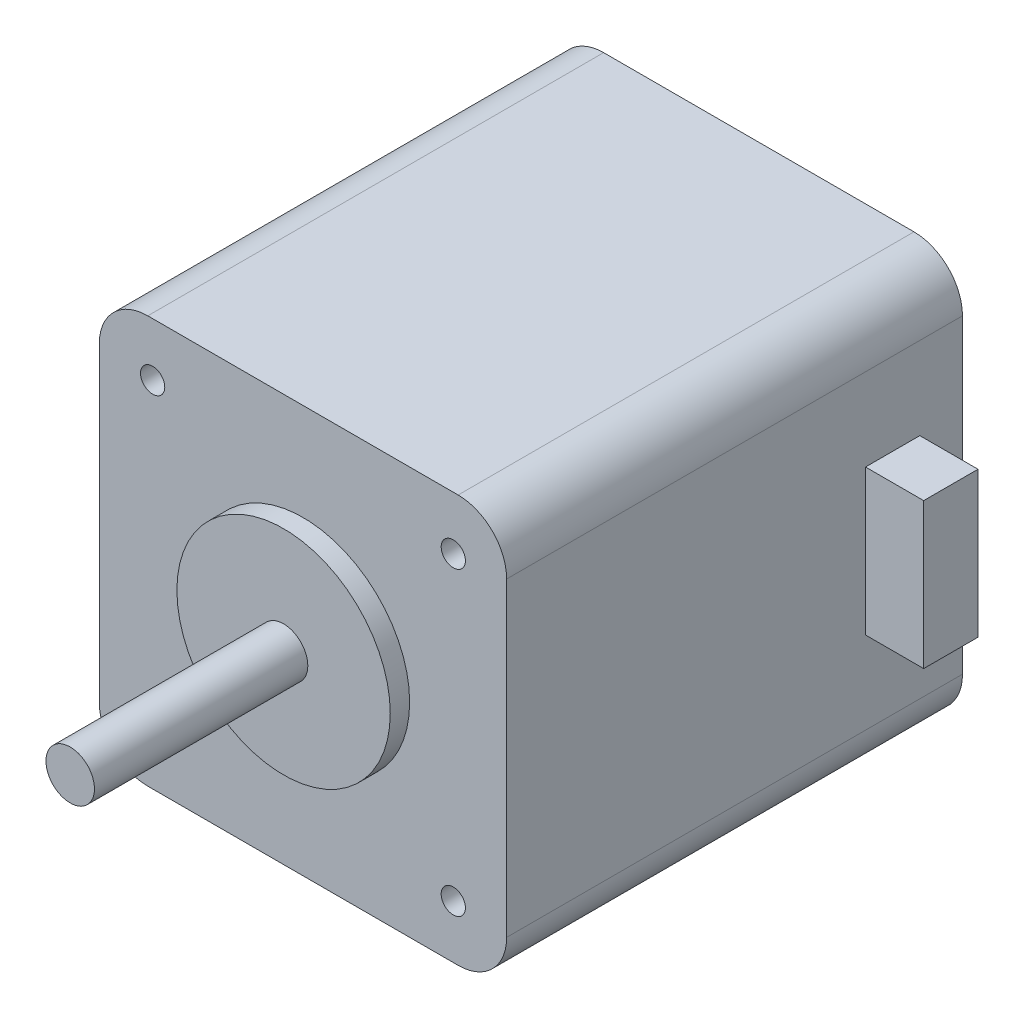
ISO-10303-21;
HEADER;
FILE_DESCRIPTION(('STEP AP214'),'2;1');
FILE_NAME('part.step','',(''),(''),'','','');
FILE_SCHEMA(('AUTOMOTIVE_DESIGN { 1 0 10303 214 1 1 1 1 }'));
ENDSEC;
DATA;
#1=APPLICATION_CONTEXT('core data for automotive mechanical design processes');
#2=APPLICATION_PROTOCOL_DEFINITION('international standard','automotive_design',2000,#1);
#3=PRODUCT_CONTEXT('',#1,'mechanical');
#4=PRODUCT('Part','Part','',(#3));
#5=PRODUCT_RELATED_PRODUCT_CATEGORY('part','',(#4));
#6=PRODUCT_DEFINITION_FORMATION('','',#4);
#7=PRODUCT_DEFINITION_CONTEXT('part definition',#1,'design');
#8=PRODUCT_DEFINITION('design','',#6,#7);
#9=PRODUCT_DEFINITION_SHAPE('','',#8);
#10=(LENGTH_UNIT() NAMED_UNIT(*) SI_UNIT(.MILLI.,.METRE.));
#11=(NAMED_UNIT(*) PLANE_ANGLE_UNIT() SI_UNIT($,.RADIAN.));
#12=(NAMED_UNIT(*) SI_UNIT($,.STERADIAN.) SOLID_ANGLE_UNIT());
#13=UNCERTAINTY_MEASURE_WITH_UNIT(LENGTH_MEASURE(1.E-05),#10,'distance_accuracy_value','');
#14=(GEOMETRIC_REPRESENTATION_CONTEXT(3) GLOBAL_UNCERTAINTY_ASSIGNED_CONTEXT((#13)) GLOBAL_UNIT_ASSIGNED_CONTEXT((#10,
#11,#12)) REPRESENTATION_CONTEXT('',''));
#15=CARTESIAN_POINT('',(0.,0.,0.));
#16=DIRECTION('',(0.,0.,1.));
#17=DIRECTION('',(1.,0.,0.));
#18=AXIS2_PLACEMENT_3D('',#15,#16,#17);
#19=CARTESIAN_POINT('',(21.,21.,47.));
#20=DIRECTION('',(1.,0.,0.));
#21=DIRECTION('',(0.,1.,0.));
#22=AXIS2_PLACEMENT_3D('',#19,#20,#21);
#23=PLANE('',#22);
#24=DIRECTION('',(0.,-1.,0.));
#25=VECTOR('',#24,1.);
#26=CARTESIAN_POINT('',(21.,21.,47.));
#27=LINE('',#26,#25);
#28=CARTESIAN_POINT('',(21.,16.,47.));
#29=VERTEX_POINT('',#28);
#30=CARTESIAN_POINT('',(21.,-16.,47.));
#31=VERTEX_POINT('',#30);
#32=EDGE_CURVE('E231',#29,#31,#27,.T.);
#33=ORIENTED_EDGE('',*,*,#32,.T.);
#34=DIRECTION('',(0.,0.,-1.));
#35=VECTOR('',#34,1.);
#36=CARTESIAN_POINT('',(21.,-16.,0.));
#37=LINE('',#36,#35);
#38=CARTESIAN_POINT('',(21.,-16.,0.));
#39=VERTEX_POINT('',#38);
#40=EDGE_CURVE('E11',#31,#39,#37,.T.);
#41=ORIENTED_EDGE('',*,*,#40,.T.);
#42=DIRECTION('',(0.,-1.,0.));
#43=VECTOR('',#42,1.);
#44=CARTESIAN_POINT('',(21.,21.,0.));
#45=LINE('',#44,#43);
#46=CARTESIAN_POINT('',(21.,16.,0.));
#47=VERTEX_POINT('',#46);
#48=EDGE_CURVE('E247',#47,#39,#45,.T.);
#49=ORIENTED_EDGE('',*,*,#48,.F.);
#50=DIRECTION('',(0.,0.,-1.));
#51=VECTOR('',#50,1.);
#52=CARTESIAN_POINT('',(21.,16.,47.));
#53=LINE('',#52,#51);
#54=EDGE_CURVE('E54',#47,#29,#53,.F.);
#55=ORIENTED_EDGE('',*,*,#54,.T.);
#56=EDGE_LOOP('',(#33,#41,#49,#55));
#57=FACE_BOUND('',#56,.T.);
#58=DIRECTION('',(0.,-1.,0.));
#59=VECTOR('',#58,1.);
#60=CARTESIAN_POINT('',(21.,7.5,10.));
#61=LINE('',#60,#59);
#62=CARTESIAN_POINT('',(21.,7.5,10.));
#63=VERTEX_POINT('',#62);
#64=CARTESIAN_POINT('',(21.,-7.5,10.));
#65=VERTEX_POINT('',#64);
#66=EDGE_CURVE('E620',#63,#65,#61,.T.);
#67=ORIENTED_EDGE('',*,*,#66,.F.);
#68=DIRECTION('',(0.,0.,1.));
#69=VECTOR('',#68,1.);
#70=CARTESIAN_POINT('',(21.,7.5,4.4));
#71=LINE('',#70,#69);
#72=CARTESIAN_POINT('',(21.,7.5,4.4));
#73=VERTEX_POINT('',#72);
#74=EDGE_CURVE('E174',#73,#63,#71,.T.);
#75=ORIENTED_EDGE('',*,*,#74,.F.);
#76=DIRECTION('',(0.,1.,0.));
#77=VECTOR('',#76,1.);
#78=CARTESIAN_POINT('',(21.,-7.5,4.4));
#79=LINE('',#78,#77);
#80=CARTESIAN_POINT('',(21.,-7.5,4.4));
#81=VERTEX_POINT('',#80);
#82=EDGE_CURVE('E170',#81,#73,#79,.T.);
#83=ORIENTED_EDGE('',*,*,#82,.F.);
#84=DIRECTION('',(0.,0.,-1.));
#85=VECTOR('',#84,1.);
#86=CARTESIAN_POINT('',(21.,-7.5,10.));
#87=LINE('',#86,#85);
#88=EDGE_CURVE('E616',#65,#81,#87,.T.);
#89=ORIENTED_EDGE('',*,*,#88,.F.);
#90=EDGE_LOOP('',(#67,#75,#83,#89));
#91=FACE_BOUND('',#90,.T.);
#92=ADVANCED_FACE('F45',(#57,#91),#23,.T.);
#93=CARTESIAN_POINT('',(0.,0.,47.));
#94=DIRECTION('',(0.,0.,-1.));
#95=DIRECTION('',(-1.,0.,0.));
#96=AXIS2_PLACEMENT_3D('',#93,#94,#95);
#97=PLANE('',#96);
#98=CARTESIAN_POINT('',(15.4999999999998,15.5000000000002,47.));
#99=DIRECTION('',(0.,0.,1.));
#100=DIRECTION('',(1.,0.,0.));
#101=AXIS2_PLACEMENT_3D('',#98,#99,#100);
#102=CIRCLE('',#101,1.25);
#103=CARTESIAN_POINT('',(16.7499999999998,15.5000000000002,47.));
#104=VERTEX_POINT('',#103);
#105=EDGE_CURVE('E177',#104,#104,#102,.T.);
#106=ORIENTED_EDGE('',*,*,#105,.F.);
#107=EDGE_LOOP('',(#106));
#108=FACE_BOUND('',#107,.T.);
#109=CARTESIAN_POINT('',(15.5,-15.5,47.));
#110=DIRECTION('',(0.,0.,1.));
#111=DIRECTION('',(1.,0.,0.));
#112=AXIS2_PLACEMENT_3D('',#109,#110,#111);
#113=CIRCLE('',#112,1.25);
#114=CARTESIAN_POINT('',(16.75,-15.5,47.));
#115=VERTEX_POINT('',#114);
#116=EDGE_CURVE('E190',#115,#115,#113,.T.);
#117=ORIENTED_EDGE('',*,*,#116,.F.);
#118=EDGE_LOOP('',(#117));
#119=FACE_BOUND('',#118,.T.);
#120=CARTESIAN_POINT('',(-15.4999999999999,-15.5000000000001,47.));
#121=DIRECTION('',(0.,0.,1.));
#122=DIRECTION('',(1.,0.,0.));
#123=AXIS2_PLACEMENT_3D('',#120,#121,#122);
#124=CIRCLE('',#123,1.25);
#125=CARTESIAN_POINT('',(-14.2499999999999,-15.5000000000001,47.));
#126=VERTEX_POINT('',#125);
#127=EDGE_CURVE('E198',#126,#126,#124,.T.);
#128=ORIENTED_EDGE('',*,*,#127,.F.);
#129=EDGE_LOOP('',(#128));
#130=FACE_BOUND('',#129,.T.);
#131=CARTESIAN_POINT('',(-15.5,15.5,47.));
#132=DIRECTION('',(0.,0.,1.));
#133=DIRECTION('',(1.,0.,0.));
#134=AXIS2_PLACEMENT_3D('',#131,#132,#133);
#135=CIRCLE('',#134,1.25);
#136=CARTESIAN_POINT('',(-14.25,15.5,47.));
#137=VERTEX_POINT('',#136);
#138=EDGE_CURVE('E206',#137,#137,#135,.T.);
#139=ORIENTED_EDGE('',*,*,#138,.F.);
#140=EDGE_LOOP('',(#139));
#141=FACE_BOUND('',#140,.T.);
#142=DIRECTION('',(0.,-1.,0.));
#143=VECTOR('',#142,1.);
#144=CARTESIAN_POINT('',(-21.,21.,47.));
#145=LINE('',#144,#143);
#146=CARTESIAN_POINT('',(-21.,16.,47.));
#147=VERTEX_POINT('',#146);
#148=CARTESIAN_POINT('',(-21.,-16.,47.));
#149=VERTEX_POINT('',#148);
#150=EDGE_CURVE('E239',#147,#149,#145,.T.);
#151=ORIENTED_EDGE('',*,*,#150,.T.);
#152=CARTESIAN_POINT('',(-16.,-16.,47.));
#153=DIRECTION('',(0.,0.,-1.));
#154=DIRECTION('',(-1.,0.,0.));
#155=AXIS2_PLACEMENT_3D('',#152,#153,#154);
#156=CIRCLE('',#155,5.);
#157=CARTESIAN_POINT('',(-16.,-21.,47.));
#158=VERTEX_POINT('',#157);
#159=EDGE_CURVE('E295',#149,#158,#156,.F.);
#160=ORIENTED_EDGE('',*,*,#159,.T.);
#161=DIRECTION('',(1.,0.,0.));
#162=VECTOR('',#161,1.);
#163=CARTESIAN_POINT('',(-21.,-21.,47.));
#164=LINE('',#163,#162);
#165=CARTESIAN_POINT('',(16.,-21.,47.));
#166=VERTEX_POINT('',#165);
#167=EDGE_CURVE('E227',#158,#166,#164,.T.);
#168=ORIENTED_EDGE('',*,*,#167,.T.);
#169=CARTESIAN_POINT('',(16.,-16.,47.));
#170=DIRECTION('',(0.,0.,-1.));
#171=DIRECTION('',(-1.,0.,0.));
#172=AXIS2_PLACEMENT_3D('',#169,#170,#171);
#173=CIRCLE('',#172,5.);
#174=EDGE_CURVE('E289',#166,#31,#173,.F.);
#175=ORIENTED_EDGE('',*,*,#174,.T.);
#176=ORIENTED_EDGE('',*,*,#32,.F.);
#177=CARTESIAN_POINT('',(16.,16.,47.));
#178=DIRECTION('',(0.,0.,-1.));
#179=DIRECTION('',(-1.,0.,0.));
#180=AXIS2_PLACEMENT_3D('',#177,#178,#179);
#181=CIRCLE('',#180,5.);
#182=CARTESIAN_POINT('',(16.,21.,47.));
#183=VERTEX_POINT('',#182);
#184=EDGE_CURVE('E69',#29,#183,#181,.F.);
#185=ORIENTED_EDGE('',*,*,#184,.T.);
#186=DIRECTION('',(1.,0.,0.));
#187=VECTOR('',#186,1.);
#188=CARTESIAN_POINT('',(-21.,21.,47.));
#189=LINE('',#188,#187);
#190=CARTESIAN_POINT('',(-16.,21.,47.));
#191=VERTEX_POINT('',#190);
#192=EDGE_CURVE('E236',#191,#183,#189,.T.);
#193=ORIENTED_EDGE('',*,*,#192,.F.);
#194=CARTESIAN_POINT('',(-16.,16.,47.));
#195=DIRECTION('',(0.,0.,-1.));
#196=DIRECTION('',(-1.,0.,0.));
#197=AXIS2_PLACEMENT_3D('',#194,#195,#196);
#198=CIRCLE('',#197,5.);
#199=EDGE_CURVE('E292',#191,#147,#198,.F.);
#200=ORIENTED_EDGE('',*,*,#199,.T.);
#201=EDGE_LOOP('',(#151,#160,#168,#175,#176,#185,#193,#200));
#202=FACE_BOUND('',#201,.T.);
#203=CARTESIAN_POINT('',(0.,0.,47.));
#204=DIRECTION('',(0.,0.,-1.));
#205=DIRECTION('',(-1.,0.,0.));
#206=AXIS2_PLACEMENT_3D('',#203,#204,#205);
#207=CIRCLE('',#206,11.);
#208=CARTESIAN_POINT('',(-11.,0.,47.));
#209=VERTEX_POINT('',#208);
#210=EDGE_CURVE('E243',#209,#209,#207,.F.);
#211=ORIENTED_EDGE('',*,*,#210,.F.);
#212=EDGE_LOOP('',(#211));
#213=FACE_BOUND('',#212,.T.);
#214=ADVANCED_FACE('F311',(#108,#119,#130,#141,#202,#213),#97,.F.);
#215=CARTESIAN_POINT('',(-21.,-21.,47.));
#216=DIRECTION('',(0.,1.,0.));
#217=DIRECTION('',(0.,0.,1.));
#218=AXIS2_PLACEMENT_3D('',#215,#216,#217);
#219=PLANE('',#218);
#220=ORIENTED_EDGE('',*,*,#167,.F.);
#221=DIRECTION('',(0.,0.,-1.));
#222=VECTOR('',#221,1.);
#223=CARTESIAN_POINT('',(-16.,-21.,47.));
#224=LINE('',#223,#222);
#225=CARTESIAN_POINT('',(-16.,-21.,0.));
#226=VERTEX_POINT('',#225);
#227=EDGE_CURVE('E264',#158,#226,#224,.T.);
#228=ORIENTED_EDGE('',*,*,#227,.T.);
#229=DIRECTION('',(1.,0.,0.));
#230=VECTOR('',#229,1.);
#231=CARTESIAN_POINT('',(-21.,-21.,0.));
#232=LINE('',#231,#230);
#233=CARTESIAN_POINT('',(16.,-21.,0.));
#234=VERTEX_POINT('',#233);
#235=EDGE_CURVE('E226',#226,#234,#232,.T.);
#236=ORIENTED_EDGE('',*,*,#235,.T.);
#237=DIRECTION('',(0.,0.,-1.));
#238=VECTOR('',#237,1.);
#239=CARTESIAN_POINT('',(16.,-21.,47.));
#240=LINE('',#239,#238);
#241=EDGE_CURVE('E261',#234,#166,#240,.F.);
#242=ORIENTED_EDGE('',*,*,#241,.T.);
#243=EDGE_LOOP('',(#220,#228,#236,#242));
#244=FACE_BOUND('',#243,.T.);
#245=ADVANCED_FACE('F337',(#244),#219,.F.);
#246=CARTESIAN_POINT('',(-21.,21.,47.));
#247=DIRECTION('',(0.,1.,0.));
#248=DIRECTION('',(0.,0.,1.));
#249=AXIS2_PLACEMENT_3D('',#246,#247,#248);
#250=PLANE('',#249);
#251=DIRECTION('',(1.,0.,0.));
#252=VECTOR('',#251,1.);
#253=CARTESIAN_POINT('',(-21.,21.,0.));
#254=LINE('',#253,#252);
#255=CARTESIAN_POINT('',(-16.,21.,0.));
#256=VERTEX_POINT('',#255);
#257=CARTESIAN_POINT('',(16.,21.,0.));
#258=VERTEX_POINT('',#257);
#259=EDGE_CURVE('E251',#256,#258,#254,.T.);
#260=ORIENTED_EDGE('',*,*,#259,.F.);
#261=DIRECTION('',(0.,0.,-1.));
#262=VECTOR('',#261,1.);
#263=CARTESIAN_POINT('',(-16.,21.,47.));
#264=LINE('',#263,#262);
#265=EDGE_CURVE('E302',#256,#191,#264,.F.);
#266=ORIENTED_EDGE('',*,*,#265,.T.);
#267=ORIENTED_EDGE('',*,*,#192,.T.);
#268=DIRECTION('',(0.,0.,-1.));
#269=VECTOR('',#268,1.);
#270=CARTESIAN_POINT('',(16.,21.,47.));
#271=LINE('',#270,#269);
#272=EDGE_CURVE('E298',#183,#258,#271,.T.);
#273=ORIENTED_EDGE('',*,*,#272,.T.);
#274=EDGE_LOOP('',(#260,#266,#267,#273));
#275=FACE_BOUND('',#274,.T.);
#276=ADVANCED_FACE('F317',(#275),#250,.T.);
#277=CARTESIAN_POINT('',(-21.,21.,47.));
#278=DIRECTION('',(1.,0.,0.));
#279=DIRECTION('',(0.,1.,0.));
#280=AXIS2_PLACEMENT_3D('',#277,#278,#279);
#281=PLANE('',#280);
#282=DIRECTION('',(0.,-1.,0.));
#283=VECTOR('',#282,1.);
#284=CARTESIAN_POINT('',(-21.,21.,0.));
#285=LINE('',#284,#283);
#286=CARTESIAN_POINT('',(-21.,16.,0.));
#287=VERTEX_POINT('',#286);
#288=CARTESIAN_POINT('',(-21.,-16.,0.));
#289=VERTEX_POINT('',#288);
#290=EDGE_CURVE('E232',#287,#289,#285,.T.);
#291=ORIENTED_EDGE('',*,*,#290,.T.);
#292=DIRECTION('',(0.,0.,-1.));
#293=VECTOR('',#292,1.);
#294=CARTESIAN_POINT('',(-21.,-16.,47.));
#295=LINE('',#294,#293);
#296=EDGE_CURVE('E284',#289,#149,#295,.F.);
#297=ORIENTED_EDGE('',*,*,#296,.T.);
#298=ORIENTED_EDGE('',*,*,#150,.F.);
#299=DIRECTION('',(0.,0.,-1.));
#300=VECTOR('',#299,1.);
#301=CARTESIAN_POINT('',(-21.,16.,0.));
#302=LINE('',#301,#300);
#303=EDGE_CURVE('E280',#147,#287,#302,.T.);
#304=ORIENTED_EDGE('',*,*,#303,.T.);
#305=EDGE_LOOP('',(#291,#297,#298,#304));
#306=FACE_BOUND('',#305,.T.);
#307=ADVANCED_FACE('F329',(#306),#281,.F.);
#308=CARTESIAN_POINT('',(0.,0.,0.));
#309=DIRECTION('',(0.,0.,-1.));
#310=DIRECTION('',(-1.,0.,0.));
#311=AXIS2_PLACEMENT_3D('',#308,#309,#310);
#312=PLANE('',#311);
#313=ORIENTED_EDGE('',*,*,#235,.F.);
#314=CARTESIAN_POINT('',(-16.,-16.,0.));
#315=DIRECTION('',(0.,0.,-1.));
#316=DIRECTION('',(-1.,0.,0.));
#317=AXIS2_PLACEMENT_3D('',#314,#315,#316);
#318=CIRCLE('',#317,5.);
#319=EDGE_CURVE('E277',#226,#289,#318,.T.);
#320=ORIENTED_EDGE('',*,*,#319,.T.);
#321=ORIENTED_EDGE('',*,*,#290,.F.);
#322=CARTESIAN_POINT('',(-16.,16.,0.));
#323=DIRECTION('',(0.,0.,-1.));
#324=DIRECTION('',(-1.,0.,0.));
#325=AXIS2_PLACEMENT_3D('',#322,#323,#324);
#326=CIRCLE('',#325,5.);
#327=EDGE_CURVE('E274',#287,#256,#326,.T.);
#328=ORIENTED_EDGE('',*,*,#327,.T.);
#329=ORIENTED_EDGE('',*,*,#259,.T.);
#330=CARTESIAN_POINT('',(16.,16.,0.));
#331=DIRECTION('',(0.,0.,-1.));
#332=DIRECTION('',(-1.,0.,0.));
#333=AXIS2_PLACEMENT_3D('',#330,#331,#332);
#334=CIRCLE('',#333,5.);
#335=EDGE_CURVE('E268',#258,#47,#334,.T.);
#336=ORIENTED_EDGE('',*,*,#335,.T.);
#337=ORIENTED_EDGE('',*,*,#48,.T.);
#338=CARTESIAN_POINT('',(16.,-16.,0.));
#339=DIRECTION('',(0.,0.,-1.));
#340=DIRECTION('',(-1.,0.,0.));
#341=AXIS2_PLACEMENT_3D('',#338,#339,#340);
#342=CIRCLE('',#341,5.);
#343=EDGE_CURVE('E271',#39,#234,#342,.T.);
#344=ORIENTED_EDGE('',*,*,#343,.T.);
#345=EDGE_LOOP('',(#313,#320,#321,#328,#329,#336,#337,#344));
#346=FACE_BOUND('',#345,.T.);
#347=ADVANCED_FACE('F321',(#346),#312,.T.);
#348=CARTESIAN_POINT('',(0.,0.,49.));
#349=DIRECTION('',(0.,0.,1.));
#350=DIRECTION('',(1.,0.,0.));
#351=AXIS2_PLACEMENT_3D('',#348,#349,#350);
#352=PLANE('',#351);
#353=CARTESIAN_POINT('',(0.,0.,49.));
#354=DIRECTION('',(0.,0.,1.));
#355=DIRECTION('',(1.,0.,0.));
#356=AXIS2_PLACEMENT_3D('',#353,#354,#355);
#357=CIRCLE('',#356,11.);
#358=CARTESIAN_POINT('',(11.,0.,49.));
#359=VERTEX_POINT('',#358);
#360=EDGE_CURVE('E218',#359,#359,#357,.T.);
#361=ORIENTED_EDGE('',*,*,#360,.T.);
#362=EDGE_LOOP('',(#361));
#363=FACE_BOUND('',#362,.T.);
#364=CARTESIAN_POINT('',(0.,0.,49.));
#365=DIRECTION('',(0.,0.,1.));
#366=DIRECTION('',(1.,0.,0.));
#367=AXIS2_PLACEMENT_3D('',#364,#365,#366);
#368=CIRCLE('',#367,2.5);
#369=CARTESIAN_POINT('',(2.5,0.,49.));
#370=VERTEX_POINT('',#369);
#371=EDGE_CURVE('E214',#370,#370,#368,.T.);
#372=ORIENTED_EDGE('',*,*,#371,.F.);
#373=EDGE_LOOP('',(#372));
#374=FACE_BOUND('',#373,.T.);
#375=ADVANCED_FACE('F402',(#363,#374),#352,.T.);
#376=CARTESIAN_POINT('',(0.,0.,49.));
#377=DIRECTION('',(0.,0.,-1.));
#378=DIRECTION('',(-1.,0.,0.));
#379=AXIS2_PLACEMENT_3D('',#376,#377,#378);
#380=CYLINDRICAL_SURFACE('',#379,11.);
#381=ORIENTED_EDGE('',*,*,#360,.F.);
#382=EDGE_LOOP('',(#381));
#383=FACE_BOUND('',#382,.T.);
#384=ORIENTED_EDGE('',*,*,#210,.T.);
#385=EDGE_LOOP('',(#384));
#386=FACE_BOUND('',#385,.T.);
#387=ADVANCED_FACE('F405',(#383,#386),#380,.T.);
#388=CARTESIAN_POINT('',(0.,0.,71.));
#389=DIRECTION('',(0.,0.,1.));
#390=DIRECTION('',(1.,0.,0.));
#391=AXIS2_PLACEMENT_3D('',#388,#389,#390);
#392=PLANE('',#391);
#393=CARTESIAN_POINT('',(0.,0.,71.));
#394=DIRECTION('',(0.,0.,1.));
#395=DIRECTION('',(1.,0.,0.));
#396=AXIS2_PLACEMENT_3D('',#393,#394,#395);
#397=CIRCLE('',#396,2.5);
#398=CARTESIAN_POINT('',(2.5,0.,71.));
#399=VERTEX_POINT('',#398);
#400=EDGE_CURVE('E222',#399,#399,#397,.T.);
#401=ORIENTED_EDGE('',*,*,#400,.T.);
#402=EDGE_LOOP('',(#401));
#403=FACE_BOUND('',#402,.T.);
#404=ADVANCED_FACE('F409',(#403),#392,.T.);
#405=CARTESIAN_POINT('',(0.,0.,71.));
#406=DIRECTION('',(0.,0.,-1.));
#407=DIRECTION('',(-1.,0.,0.));
#408=AXIS2_PLACEMENT_3D('',#405,#406,#407);
#409=CYLINDRICAL_SURFACE('',#408,2.5);
#410=ORIENTED_EDGE('',*,*,#371,.T.);
#411=EDGE_LOOP('',(#410));
#412=FACE_BOUND('',#411,.T.);
#413=ORIENTED_EDGE('',*,*,#400,.F.);
#414=EDGE_LOOP('',(#413));
#415=FACE_BOUND('',#414,.T.);
#416=ADVANCED_FACE('F400',(#412,#415),#409,.T.);
#417=CARTESIAN_POINT('',(-15.5,15.5,41.));
#418=DIRECTION('',(0.,0.,1.));
#419=DIRECTION('',(1.,0.,0.));
#420=AXIS2_PLACEMENT_3D('',#417,#418,#419);
#421=CONICAL_SURFACE('',#420,1.25,1.02974425867665);
#422=CARTESIAN_POINT('',(-15.5,15.5,40.2489242262155));
#423=VERTEX_POINT('',#422);
#424=VERTEX_LOOP('',#423);
#425=FACE_BOUND('',#424,.T.);
#426=CARTESIAN_POINT('',(-15.5,15.5,41.));
#427=DIRECTION('',(0.,0.,1.));
#428=DIRECTION('',(1.,0.,0.));
#429=AXIS2_PLACEMENT_3D('',#426,#427,#428);
#430=CIRCLE('',#429,1.25);
#431=CARTESIAN_POINT('',(-14.25,15.5,41.));
#432=VERTEX_POINT('',#431);
#433=EDGE_CURVE('E210',#432,#432,#430,.T.);
#434=ORIENTED_EDGE('',*,*,#433,.T.);
#435=EDGE_LOOP('',(#434));
#436=FACE_BOUND('',#435,.T.);
#437=ADVANCED_FACE('F396',(#425,#436),#421,.F.);
#438=CARTESIAN_POINT('',(-15.5,15.5,47.));
#439=DIRECTION('',(0.,0.,1.));
#440=DIRECTION('',(1.,0.,0.));
#441=AXIS2_PLACEMENT_3D('',#438,#439,#440);
#442=CYLINDRICAL_SURFACE('',#441,1.25);
#443=ORIENTED_EDGE('',*,*,#433,.F.);
#444=EDGE_LOOP('',(#443));
#445=FACE_BOUND('',#444,.T.);
#446=ORIENTED_EDGE('',*,*,#138,.T.);
#447=EDGE_LOOP('',(#446));
#448=FACE_BOUND('',#447,.T.);
#449=ADVANCED_FACE('F392',(#445,#448),#442,.F.);
#450=CARTESIAN_POINT('',(-15.4999999999999,-15.5000000000001,41.));
#451=DIRECTION('',(0.,0.,1.));
#452=DIRECTION('',(1.,0.,0.));
#453=AXIS2_PLACEMENT_3D('',#450,#451,#452);
#454=CONICAL_SURFACE('',#453,1.25,1.02974425867665);
#455=CARTESIAN_POINT('',(-15.4999999999999,-15.5000000000001,40.2489242262155));
#456=VERTEX_POINT('',#455);
#457=VERTEX_LOOP('',#456);
#458=FACE_BOUND('',#457,.T.);
#459=CARTESIAN_POINT('',(-15.4999999999999,-15.5000000000001,41.));
#460=DIRECTION('',(0.,0.,1.));
#461=DIRECTION('',(1.,0.,0.));
#462=AXIS2_PLACEMENT_3D('',#459,#460,#461);
#463=CIRCLE('',#462,1.25);
#464=CARTESIAN_POINT('',(-14.2499999999999,-15.5000000000001,41.));
#465=VERTEX_POINT('',#464);
#466=EDGE_CURVE('E202',#465,#465,#463,.T.);
#467=ORIENTED_EDGE('',*,*,#466,.T.);
#468=EDGE_LOOP('',(#467));
#469=FACE_BOUND('',#468,.T.);
#470=ADVANCED_FACE('F388',(#458,#469),#454,.F.);
#471=CARTESIAN_POINT('',(-15.4999999999999,-15.5000000000001,47.));
#472=DIRECTION('',(0.,0.,1.));
#473=DIRECTION('',(1.,0.,0.));
#474=AXIS2_PLACEMENT_3D('',#471,#472,#473);
#475=CYLINDRICAL_SURFACE('',#474,1.25);
#476=ORIENTED_EDGE('',*,*,#466,.F.);
#477=EDGE_LOOP('',(#476));
#478=FACE_BOUND('',#477,.T.);
#479=ORIENTED_EDGE('',*,*,#127,.T.);
#480=EDGE_LOOP('',(#479));
#481=FACE_BOUND('',#480,.T.);
#482=ADVANCED_FACE('F384',(#478,#481),#475,.F.);
#483=CARTESIAN_POINT('',(15.5,-15.5,41.));
#484=DIRECTION('',(0.,0.,1.));
#485=DIRECTION('',(1.,0.,0.));
#486=AXIS2_PLACEMENT_3D('',#483,#484,#485);
#487=CONICAL_SURFACE('',#486,1.25,1.02974425867665);
#488=CARTESIAN_POINT('',(15.5,-15.5,40.2489242262155));
#489=VERTEX_POINT('',#488);
#490=VERTEX_LOOP('',#489);
#491=FACE_BOUND('',#490,.T.);
#492=CARTESIAN_POINT('',(15.5,-15.5,41.));
#493=DIRECTION('',(0.,0.,1.));
#494=DIRECTION('',(1.,0.,0.));
#495=AXIS2_PLACEMENT_3D('',#492,#493,#494);
#496=CIRCLE('',#495,1.25);
#497=CARTESIAN_POINT('',(16.75,-15.5,41.));
#498=VERTEX_POINT('',#497);
#499=EDGE_CURVE('E194',#498,#498,#496,.T.);
#500=ORIENTED_EDGE('',*,*,#499,.T.);
#501=EDGE_LOOP('',(#500));
#502=FACE_BOUND('',#501,.T.);
#503=ADVANCED_FACE('F380',(#491,#502),#487,.F.);
#504=CARTESIAN_POINT('',(15.5,-15.5,47.));
#505=DIRECTION('',(0.,0.,1.));
#506=DIRECTION('',(1.,0.,0.));
#507=AXIS2_PLACEMENT_3D('',#504,#505,#506);
#508=CYLINDRICAL_SURFACE('',#507,1.25);
#509=ORIENTED_EDGE('',*,*,#499,.F.);
#510=EDGE_LOOP('',(#509));
#511=FACE_BOUND('',#510,.T.);
#512=ORIENTED_EDGE('',*,*,#116,.T.);
#513=EDGE_LOOP('',(#512));
#514=FACE_BOUND('',#513,.T.);
#515=ADVANCED_FACE('F370',(#511,#514),#508,.F.);
#516=CARTESIAN_POINT('',(15.4999999999998,15.5000000000002,41.));
#517=DIRECTION('',(0.,0.,1.));
#518=DIRECTION('',(1.,0.,0.));
#519=AXIS2_PLACEMENT_3D('',#516,#517,#518);
#520=CONICAL_SURFACE('',#519,1.25,1.02974425867665);
#521=CARTESIAN_POINT('',(15.4999999999998,15.5000000000002,40.2489242262155));
#522=VERTEX_POINT('',#521);
#523=VERTEX_LOOP('',#522);
#524=FACE_BOUND('',#523,.T.);
#525=CARTESIAN_POINT('',(15.4999999999998,15.5000000000002,41.));
#526=DIRECTION('',(0.,0.,1.));
#527=DIRECTION('',(1.,0.,0.));
#528=AXIS2_PLACEMENT_3D('',#525,#526,#527);
#529=CIRCLE('',#528,1.25);
#530=CARTESIAN_POINT('',(16.7499999999998,15.5000000000002,41.));
#531=VERTEX_POINT('',#530);
#532=EDGE_CURVE('E182',#531,#531,#529,.T.);
#533=ORIENTED_EDGE('',*,*,#532,.T.);
#534=EDGE_LOOP('',(#533));
#535=FACE_BOUND('',#534,.T.);
#536=ADVANCED_FACE('F364',(#524,#535),#520,.F.);
#537=CARTESIAN_POINT('',(15.4999999999998,15.5000000000002,47.));
#538=DIRECTION('',(0.,0.,1.));
#539=DIRECTION('',(1.,0.,0.));
#540=AXIS2_PLACEMENT_3D('',#537,#538,#539);
#541=CYLINDRICAL_SURFACE('',#540,1.25);
#542=ORIENTED_EDGE('',*,*,#532,.F.);
#543=EDGE_LOOP('',(#542));
#544=FACE_BOUND('',#543,.T.);
#545=ORIENTED_EDGE('',*,*,#105,.T.);
#546=EDGE_LOOP('',(#545));
#547=FACE_BOUND('',#546,.T.);
#548=ADVANCED_FACE('F360',(#544,#547),#541,.F.);
#549=CARTESIAN_POINT('',(-16.,-16.,47.));
#550=DIRECTION('',(0.,0.,-1.));
#551=DIRECTION('',(-1.,0.,0.));
#552=AXIS2_PLACEMENT_3D('',#549,#550,#551);
#553=CYLINDRICAL_SURFACE('',#552,5.);
#554=ORIENTED_EDGE('',*,*,#159,.F.);
#555=ORIENTED_EDGE('',*,*,#296,.F.);
#556=ORIENTED_EDGE('',*,*,#319,.F.);
#557=ORIENTED_EDGE('',*,*,#227,.F.);
#558=EDGE_LOOP('',(#554,#555,#556,#557));
#559=FACE_BOUND('',#558,.T.);
#560=ADVANCED_FACE('F335',(#559),#553,.T.);
#561=CARTESIAN_POINT('',(-16.,16.,47.));
#562=DIRECTION('',(0.,0.,1.));
#563=DIRECTION('',(1.,0.,0.));
#564=AXIS2_PLACEMENT_3D('',#561,#562,#563);
#565=CYLINDRICAL_SURFACE('',#564,5.);
#566=ORIENTED_EDGE('',*,*,#199,.F.);
#567=ORIENTED_EDGE('',*,*,#265,.F.);
#568=ORIENTED_EDGE('',*,*,#327,.F.);
#569=ORIENTED_EDGE('',*,*,#303,.F.);
#570=EDGE_LOOP('',(#566,#567,#568,#569));
#571=FACE_BOUND('',#570,.T.);
#572=ADVANCED_FACE('F326',(#571),#565,.T.);
#573=CARTESIAN_POINT('',(16.,-16.,47.));
#574=DIRECTION('',(0.,0.,1.));
#575=DIRECTION('',(1.,0.,0.));
#576=AXIS2_PLACEMENT_3D('',#573,#574,#575);
#577=CYLINDRICAL_SURFACE('',#576,5.);
#578=ORIENTED_EDGE('',*,*,#174,.F.);
#579=ORIENTED_EDGE('',*,*,#241,.F.);
#580=ORIENTED_EDGE('',*,*,#343,.F.);
#581=ORIENTED_EDGE('',*,*,#40,.F.);
#582=EDGE_LOOP('',(#578,#579,#580,#581));
#583=FACE_BOUND('',#582,.T.);
#584=ADVANCED_FACE('F340',(#583),#577,.T.);
#585=CARTESIAN_POINT('',(16.,16.,47.));
#586=DIRECTION('',(0.,0.,-1.));
#587=DIRECTION('',(-1.,0.,0.));
#588=AXIS2_PLACEMENT_3D('',#585,#586,#587);
#589=CYLINDRICAL_SURFACE('',#588,5.);
#590=ORIENTED_EDGE('',*,*,#184,.F.);
#591=ORIENTED_EDGE('',*,*,#54,.F.);
#592=ORIENTED_EDGE('',*,*,#335,.F.);
#593=ORIENTED_EDGE('',*,*,#272,.F.);
#594=EDGE_LOOP('',(#590,#591,#592,#593));
#595=FACE_BOUND('',#594,.T.);
#596=ADVANCED_FACE('F47',(#595),#589,.T.);
#597=CARTESIAN_POINT('',(27.,7.5,4.4));
#598=DIRECTION('',(0.,-1.,0.));
#599=DIRECTION('',(1.,0.,0.));
#600=AXIS2_PLACEMENT_3D('',#597,#598,#599);
#601=PLANE('',#600);
#602=ORIENTED_EDGE('',*,*,#74,.T.);
#603=DIRECTION('',(-1.,0.,0.));
#604=VECTOR('',#603,1.);
#605=CARTESIAN_POINT('',(27.,7.5,10.));
#606=LINE('',#605,#604);
#607=CARTESIAN_POINT('',(27.,7.5,10.));
#608=VERTEX_POINT('',#607);
#609=EDGE_CURVE('E153',#608,#63,#606,.T.);
#610=ORIENTED_EDGE('',*,*,#609,.F.);
#611=DIRECTION('',(0.,0.,1.));
#612=VECTOR('',#611,1.);
#613=CARTESIAN_POINT('',(27.,7.5,4.4));
#614=LINE('',#613,#612);
#615=CARTESIAN_POINT('',(27.,7.5,4.4));
#616=VERTEX_POINT('',#615);
#617=EDGE_CURVE('E161',#616,#608,#614,.T.);
#618=ORIENTED_EDGE('',*,*,#617,.F.);
#619=DIRECTION('',(-1.,0.,0.));
#620=VECTOR('',#619,1.);
#621=CARTESIAN_POINT('',(27.,7.5,4.4));
#622=LINE('',#621,#620);
#623=EDGE_CURVE('E613',#616,#73,#622,.T.);
#624=ORIENTED_EDGE('',*,*,#623,.T.);
#625=EDGE_LOOP('',(#602,#610,#618,#624));
#626=FACE_BOUND('',#625,.T.);
#627=ADVANCED_FACE('F172',(#626),#601,.F.);
#628=CARTESIAN_POINT('',(27.,7.5,10.));
#629=DIRECTION('',(0.,0.,-1.));
#630=DIRECTION('',(-1.,0.,0.));
#631=AXIS2_PLACEMENT_3D('',#628,#629,#630);
#632=PLANE('',#631);
#633=ORIENTED_EDGE('',*,*,#66,.T.);
#634=DIRECTION('',(-1.,0.,0.));
#635=VECTOR('',#634,1.);
#636=CARTESIAN_POINT('',(27.,-7.5,10.));
#637=LINE('',#636,#635);
#638=CARTESIAN_POINT('',(27.,-7.5,10.));
#639=VERTEX_POINT('',#638);
#640=EDGE_CURVE('E156',#639,#65,#637,.T.);
#641=ORIENTED_EDGE('',*,*,#640,.F.);
#642=DIRECTION('',(0.,-1.,0.));
#643=VECTOR('',#642,1.);
#644=CARTESIAN_POINT('',(27.,7.5,10.));
#645=LINE('',#644,#643);
#646=EDGE_CURVE('E149',#608,#639,#645,.T.);
#647=ORIENTED_EDGE('',*,*,#646,.F.);
#648=ORIENTED_EDGE('',*,*,#609,.T.);
#649=EDGE_LOOP('',(#633,#641,#647,#648));
#650=FACE_BOUND('',#649,.T.);
#651=ADVANCED_FACE('F151',(#650),#632,.F.);
#652=CARTESIAN_POINT('',(27.,-7.5,10.));
#653=DIRECTION('',(0.,1.,0.));
#654=DIRECTION('',(-1.,0.,0.));
#655=AXIS2_PLACEMENT_3D('',#652,#653,#654);
#656=PLANE('',#655);
#657=ORIENTED_EDGE('',*,*,#88,.T.);
#658=DIRECTION('',(-1.,0.,0.));
#659=VECTOR('',#658,1.);
#660=CARTESIAN_POINT('',(27.,-7.5,4.4));
#661=LINE('',#660,#659);
#662=CARTESIAN_POINT('',(27.,-7.5,4.4));
#663=VERTEX_POINT('',#662);
#664=EDGE_CURVE('E61',#663,#81,#661,.T.);
#665=ORIENTED_EDGE('',*,*,#664,.F.);
#666=DIRECTION('',(0.,0.,-1.));
#667=VECTOR('',#666,1.);
#668=CARTESIAN_POINT('',(27.,-7.5,10.));
#669=LINE('',#668,#667);
#670=EDGE_CURVE('E160',#639,#663,#669,.T.);
#671=ORIENTED_EDGE('',*,*,#670,.F.);
#672=ORIENTED_EDGE('',*,*,#640,.T.);
#673=EDGE_LOOP('',(#657,#665,#671,#672));
#674=FACE_BOUND('',#673,.T.);
#675=ADVANCED_FACE('F583',(#674),#656,.F.);
#676=CARTESIAN_POINT('',(27.,-7.5,4.4));
#677=DIRECTION('',(0.,0.,1.));
#678=DIRECTION('',(1.,0.,0.));
#679=AXIS2_PLACEMENT_3D('',#676,#677,#678);
#680=PLANE('',#679);
#681=ORIENTED_EDGE('',*,*,#82,.T.);
#682=ORIENTED_EDGE('',*,*,#623,.F.);
#683=DIRECTION('',(0.,1.,0.));
#684=VECTOR('',#683,1.);
#685=CARTESIAN_POINT('',(27.,-7.5,4.4));
#686=LINE('',#685,#684);
#687=EDGE_CURVE('E165',#663,#616,#686,.T.);
#688=ORIENTED_EDGE('',*,*,#687,.F.);
#689=ORIENTED_EDGE('',*,*,#664,.T.);
#690=EDGE_LOOP('',(#681,#682,#688,#689));
#691=FACE_BOUND('',#690,.T.);
#692=ADVANCED_FACE('F591',(#691),#680,.F.);
#693=CARTESIAN_POINT('',(27.,0.,0.));
#694=DIRECTION('',(1.,0.,0.));
#695=DIRECTION('',(0.,0.,-1.));
#696=AXIS2_PLACEMENT_3D('',#693,#694,#695);
#697=PLANE('',#696);
#698=ORIENTED_EDGE('',*,*,#617,.T.);
#699=ORIENTED_EDGE('',*,*,#646,.T.);
#700=ORIENTED_EDGE('',*,*,#670,.T.);
#701=ORIENTED_EDGE('',*,*,#687,.T.);
#702=EDGE_LOOP('',(#698,#699,#700,#701));
#703=FACE_BOUND('',#702,.T.);
#704=ADVANCED_FACE('F164',(#703),#697,.T.);
#705=CLOSED_SHELL('',(#92,#214,#245,#276,#307,#347,#375,#387,#404,#416,#437,#449,#470,#482,#503,
#515,#536,#548,#560,#572,#584,#596,#627,#651,#675,#692,#704));
#706=MANIFOLD_SOLID_BREP('B2',#705);
#707=ADVANCED_BREP_SHAPE_REPRESENTATION('',(#18,#706),#14);
#708=SHAPE_DEFINITION_REPRESENTATION(#9,#707);
ENDSEC;
END-ISO-10303-21;
